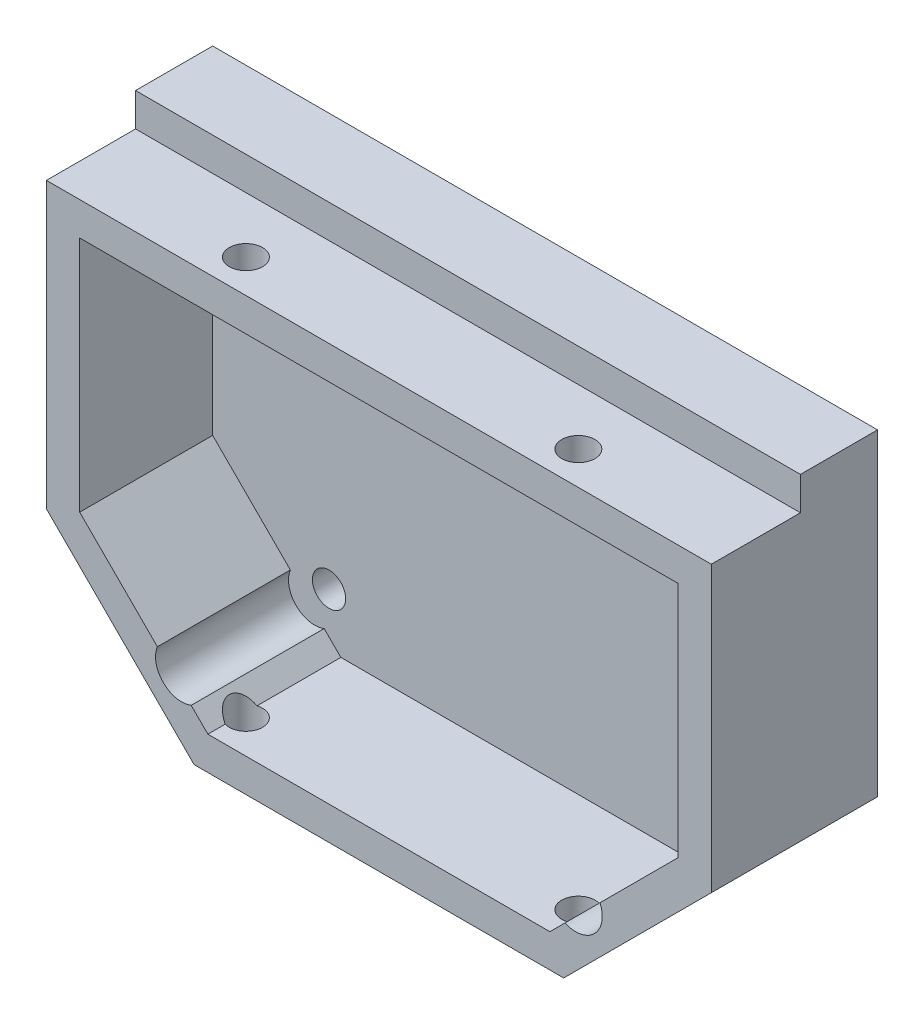
ISO-10303-21;
HEADER;
FILE_DESCRIPTION(('STEP AP214'),'2;1');
FILE_NAME('part.step','',(''),(''),'','','');
FILE_SCHEMA(('AUTOMOTIVE_DESIGN { 1 0 10303 214 1 1 1 1 }'));
ENDSEC;
DATA;
#1=APPLICATION_CONTEXT('core data for automotive mechanical design processes');
#2=APPLICATION_PROTOCOL_DEFINITION('international standard','automotive_design',2000,#1);
#3=PRODUCT_CONTEXT('',#1,'mechanical');
#4=PRODUCT('Part','Part','',(#3));
#5=PRODUCT_RELATED_PRODUCT_CATEGORY('part','',(#4));
#6=PRODUCT_DEFINITION_FORMATION('','',#4);
#7=PRODUCT_DEFINITION_CONTEXT('part definition',#1,'design');
#8=PRODUCT_DEFINITION('design','',#6,#7);
#9=PRODUCT_DEFINITION_SHAPE('','',#8);
#10=(LENGTH_UNIT() NAMED_UNIT(*) SI_UNIT(.MILLI.,.METRE.));
#11=(NAMED_UNIT(*) PLANE_ANGLE_UNIT() SI_UNIT($,.RADIAN.));
#12=(NAMED_UNIT(*) SI_UNIT($,.STERADIAN.) SOLID_ANGLE_UNIT());
#13=UNCERTAINTY_MEASURE_WITH_UNIT(LENGTH_MEASURE(1.E-05),#10,'distance_accuracy_value','');
#14=(GEOMETRIC_REPRESENTATION_CONTEXT(3) GLOBAL_UNCERTAINTY_ASSIGNED_CONTEXT((#13)) GLOBAL_UNIT_ASSIGNED_CONTEXT((#10,
#11,#12)) REPRESENTATION_CONTEXT('',''));
#15=CARTESIAN_POINT('',(0.,0.,0.));
#16=DIRECTION('',(0.,0.,1.));
#17=DIRECTION('',(1.,0.,0.));
#18=AXIS2_PLACEMENT_3D('',#15,#16,#17);
#19=CARTESIAN_POINT('',(26.2059485512443,-27.7968646304275,-12.));
#20=DIRECTION('',(0.707106781186547,-0.707106781186547,0.));
#21=DIRECTION('',(0.707106781186548,0.707106781186548,0.));
#22=AXIS2_PLACEMENT_3D('',#19,#20,#21);
#23=PLANE('',#22);
#24=DIRECTION('',(0.707106781186548,0.707106781186548,0.));
#25=VECTOR('',#24,1.);
#26=CARTESIAN_POINT('',(27.0014065908359,-27.0014065908359,-7.));
#27=LINE('',#26,#25);
#28=CARTESIAN_POINT('',(35.2046858702732,-18.7981273113986,-7.));
#29=VERTEX_POINT('',#28);
#30=CARTESIAN_POINT('',(46.9493152511216,-7.05349793055018,-7.));
#31=VERTEX_POINT('',#30);
#32=EDGE_CURVE('E302',#29,#31,#27,.T.);
#33=ORIENTED_EDGE('',*,*,#32,.F.);
#34=DIRECTION('',(0.,0.,1.));
#35=VECTOR('',#34,1.);
#36=CARTESIAN_POINT('',(35.2046858702732,-18.7981273113986,-14.9280834693644));
#37=LINE('',#36,#35);
#38=CARTESIAN_POINT('',(35.2046858702732,-18.7981273113986,13.));
#39=VERTEX_POINT('',#38);
#40=EDGE_CURVE('E58',#29,#39,#37,.T.);
#41=ORIENTED_EDGE('',*,*,#40,.T.);
#42=DIRECTION('',(0.707106781186548,0.707106781186548,0.));
#43=VECTOR('',#42,1.);
#44=CARTESIAN_POINT('',(27.0014065908359,-27.0014065908359,13.));
#45=LINE('',#44,#43);
#46=CARTESIAN_POINT('',(46.9493152511216,-7.05349793055018,13.));
#47=VERTEX_POINT('',#46);
#48=EDGE_CURVE('E321',#39,#47,#45,.T.);
#49=ORIENTED_EDGE('',*,*,#48,.T.);
#50=DIRECTION('',(0.,0.,1.));
#51=VECTOR('',#50,1.);
#52=CARTESIAN_POINT('',(46.9493152511216,-7.05349793055018,-12.));
#53=LINE('',#52,#51);
#54=EDGE_CURVE('E288',#31,#47,#53,.T.);
#55=ORIENTED_EDGE('',*,*,#54,.F.);
#56=EDGE_LOOP('',(#33,#41,#49,#55));
#57=FACE_BOUND('',#56,.T.);
#58=ADVANCED_FACE('F33',(#57),#23,.F.);
#59=CARTESIAN_POINT('',(-44.5151508429457,-5.58903183648288,-12.));
#60=DIRECTION('',(-0.707106781186539,-0.707106781186556,0.));
#61=DIRECTION('',(0.707106781186556,-0.707106781186539,0.));
#62=AXIS2_PLACEMENT_3D('',#59,#60,#61);
#63=PLANE('',#62);
#64=DIRECTION('',(0.707106781186556,-0.707106781186539,0.));
#65=VECTOR('',#64,1.);
#66=CARTESIAN_POINT('',(-25.0520913397137,-25.0520913397144,-7.));
#67=LINE('',#66,#65);
#68=CARTESIAN_POINT('',(-26.2791792303385,-23.8250034490896,-7.));
#69=VERTEX_POINT('',#68);
#70=CARTESIAN_POINT('',(-23.7717841430678,-26.3323985363603,-7.));
#71=VERTEX_POINT('',#70);
#72=EDGE_CURVE('E284',#69,#71,#67,.T.);
#73=ORIENTED_EDGE('',*,*,#72,.F.);
#74=DIRECTION('',(0.,0.,1.));
#75=VECTOR('',#74,1.);
#76=CARTESIAN_POINT('',(-26.2791792303386,-23.8250034490897,-14.9280834693644));
#77=LINE('',#76,#75);
#78=CARTESIAN_POINT('',(-26.2791792303386,-23.8250034490897,13.));
#79=VERTEX_POINT('',#78);
#80=EDGE_CURVE('E221',#69,#79,#77,.T.);
#81=ORIENTED_EDGE('',*,*,#80,.T.);
#82=DIRECTION('',(0.707106781186556,-0.707106781186539,0.));
#83=VECTOR('',#82,1.);
#84=CARTESIAN_POINT('',(-25.0520913397137,-25.0520913397144,13.));
#85=LINE('',#84,#83);
#86=CARTESIAN_POINT('',(-23.7717841430678,-26.3323985363603,13.));
#87=VERTEX_POINT('',#86);
#88=EDGE_CURVE('E314',#79,#87,#85,.T.);
#89=ORIENTED_EDGE('',*,*,#88,.T.);
#90=DIRECTION('',(0.,0.,1.));
#91=VECTOR('',#90,1.);
#92=CARTESIAN_POINT('',(-23.7717841430678,-26.3323985363603,-12.));
#93=LINE('',#92,#91);
#94=CARTESIAN_POINT('',(-23.7717841430678,-26.3323985363603,10.3937451125171));
#95=VERTEX_POINT('',#94);
#96=EDGE_CURVE('E275',#95,#87,#93,.T.);
#97=ORIENTED_EDGE('',*,*,#96,.F.);
#98=CARTESIAN_POINT('',(-23.0506847488784,-27.0534979305497,8.));
#99=DIRECTION('',(-0.707106781186539,-0.707106781186556,0.));
#100=DIRECTION('',(0.707106781186556,-0.707106781186539,0.));
#101=AXIS2_PLACEMENT_3D('',#98,#99,#100);
#102=ELLIPSE('',#101,3.53553390593269,2.5);
#103=CARTESIAN_POINT('',(-23.7717841430678,-26.3323985363603,5.60625488748287));
#104=VERTEX_POINT('',#103);
#105=EDGE_CURVE('E42',#95,#104,#102,.T.);
#106=ORIENTED_EDGE('',*,*,#105,.T.);
#107=EDGE_CURVE('E303',#71,#104,#93,.T.);
#108=ORIENTED_EDGE('',*,*,#107,.F.);
#109=EDGE_LOOP('',(#73,#81,#89,#97,#106,#108));
#110=FACE_BOUND('',#109,.T.);
#111=ADVANCED_FACE('F431',(#110),#63,.F.);
#112=CARTESIAN_POINT('',(-48.0506847488784,33.6676014636397,-12.));
#113=DIRECTION('',(-1.,0.,0.));
#114=DIRECTION('',(0.,0.,1.));
#115=AXIS2_PLACEMENT_3D('',#112,#113,#114);
#116=PLANE('',#115);
#117=DIRECTION('',(0.,0.,1.));
#118=VECTOR('',#117,1.);
#119=CARTESIAN_POINT('',(-48.0506847488784,-9.12456574241567,-12.));
#120=LINE('',#119,#118);
#121=CARTESIAN_POINT('',(-48.0506847488784,-9.12456574241567,-12.));
#122=VERTEX_POINT('',#121);
#123=CARTESIAN_POINT('',(-48.0506847488784,-9.12456574241567,13.));
#124=VERTEX_POINT('',#123);
#125=EDGE_CURVE('E359',#122,#124,#120,.T.);
#126=ORIENTED_EDGE('',*,*,#125,.T.);
#127=DIRECTION('',(0.,-1.,0.));
#128=VECTOR('',#127,1.);
#129=CARTESIAN_POINT('',(-48.0506847488784,33.6676014636397,13.));
#130=LINE('',#129,#128);
#131=CARTESIAN_POINT('',(-48.0506847488784,33.6676014636397,13.));
#132=VERTEX_POINT('',#131);
#133=EDGE_CURVE('E279',#132,#124,#130,.T.);
#134=ORIENTED_EDGE('',*,*,#133,.F.);
#135=DIRECTION('',(0.,0.,1.));
#136=VECTOR('',#135,1.);
#137=CARTESIAN_POINT('',(-48.0506847488784,33.6676014636397,-12.));
#138=LINE('',#137,#136);
#139=CARTESIAN_POINT('',(-48.0506847488784,33.6676014636397,-0.400000000000001));
#140=VERTEX_POINT('',#139);
#141=EDGE_CURVE('E194',#140,#132,#138,.T.);
#142=ORIENTED_EDGE('',*,*,#141,.F.);
#143=DIRECTION('',(0.,-1.,0.));
#144=VECTOR('',#143,1.);
#145=CARTESIAN_POINT('',(-48.0506847488784,38.6676014636397,-0.400000000000001));
#146=LINE('',#145,#144);
#147=CARTESIAN_POINT('',(-48.0506847488784,38.6676014636397,-0.400000000000001));
#148=VERTEX_POINT('',#147);
#149=EDGE_CURVE('E176',#148,#140,#146,.T.);
#150=ORIENTED_EDGE('',*,*,#149,.F.);
#151=DIRECTION('',(0.,0.,1.));
#152=VECTOR('',#151,1.);
#153=CARTESIAN_POINT('',(-48.0506847488784,38.6676014636397,-12.));
#154=LINE('',#153,#152);
#155=CARTESIAN_POINT('',(-48.0506847488784,38.6676014636397,-12.));
#156=VERTEX_POINT('',#155);
#157=EDGE_CURVE('E183',#156,#148,#154,.T.);
#158=ORIENTED_EDGE('',*,*,#157,.F.);
#159=DIRECTION('',(0.,-1.,0.));
#160=VECTOR('',#159,1.);
#161=CARTESIAN_POINT('',(-48.0506847488784,33.6676014636397,-12.));
#162=LINE('',#161,#160);
#163=EDGE_CURVE('E346',#156,#122,#162,.T.);
#164=ORIENTED_EDGE('',*,*,#163,.T.);
#165=EDGE_LOOP('',(#126,#134,#142,#150,#158,#164));
#166=FACE_BOUND('',#165,.T.);
#167=ADVANCED_FACE('F35',(#166),#116,.T.);
#168=CARTESIAN_POINT('',(-48.0506847488784,33.6676014636397,-12.));
#169=DIRECTION('',(0.,1.,0.));
#170=DIRECTION('',(-1.,0.,0.));
#171=AXIS2_PLACEMENT_3D('',#168,#169,#170);
#172=PLANE('',#171);
#173=DIRECTION('',(1.,0.,0.));
#174=VECTOR('',#173,1.);
#175=CARTESIAN_POINT('',(-48.0506847488784,33.6676014636397,-0.400000000000001));
#176=LINE('',#175,#174);
#177=CARTESIAN_POINT('',(51.9493152511216,33.6676014636397,-0.400000000000001));
#178=VERTEX_POINT('',#177);
#179=EDGE_CURVE('E50',#140,#178,#176,.T.);
#180=ORIENTED_EDGE('',*,*,#179,.F.);
#181=ORIENTED_EDGE('',*,*,#141,.T.);
#182=DIRECTION('',(-1.,0.,0.));
#183=VECTOR('',#182,1.);
#184=CARTESIAN_POINT('',(44.1184363078764,33.6676014636397,13.));
#185=LINE('',#184,#183);
#186=CARTESIAN_POINT('',(51.9493152511216,33.6676014636397,13.));
#187=VERTEX_POINT('',#186);
#188=EDGE_CURVE('E343',#187,#132,#185,.T.);
#189=ORIENTED_EDGE('',*,*,#188,.F.);
#190=DIRECTION('',(0.,0.,1.));
#191=VECTOR('',#190,1.);
#192=CARTESIAN_POINT('',(51.9493152511216,33.6676014636397,-12.));
#193=LINE('',#192,#191);
#194=EDGE_CURVE('E203',#178,#187,#193,.T.);
#195=ORIENTED_EDGE('',*,*,#194,.F.);
#196=EDGE_LOOP('',(#180,#181,#189,#195));
#197=FACE_BOUND('',#196,.T.);
#198=CARTESIAN_POINT('',(26.9493152511216,33.6676014636397,8.));
#199=DIRECTION('',(0.,1.,0.));
#200=DIRECTION('',(-1.,0.,0.));
#201=AXIS2_PLACEMENT_3D('',#198,#199,#200);
#202=CIRCLE('',#201,2.5);
#203=CARTESIAN_POINT('',(24.4493152511216,33.6676014636397,8.));
#204=VERTEX_POINT('',#203);
#205=EDGE_CURVE('E251',#204,#204,#202,.F.);
#206=ORIENTED_EDGE('',*,*,#205,.T.);
#207=EDGE_LOOP('',(#206));
#208=FACE_BOUND('',#207,.T.);
#209=CARTESIAN_POINT('',(-23.0506847488784,33.6676014636397,8.));
#210=DIRECTION('',(0.,1.,0.));
#211=DIRECTION('',(-1.,0.,0.));
#212=AXIS2_PLACEMENT_3D('',#209,#210,#211);
#213=CIRCLE('',#212,2.5);
#214=CARTESIAN_POINT('',(-25.5506847488784,33.6676014636397,8.));
#215=VERTEX_POINT('',#214);
#216=EDGE_CURVE('E263',#215,#215,#213,.F.);
#217=ORIENTED_EDGE('',*,*,#216,.T.);
#218=EDGE_LOOP('',(#217));
#219=FACE_BOUND('',#218,.T.);
#220=ADVANCED_FACE('F379',(#197,#208,#219),#172,.T.);
#221=CARTESIAN_POINT('',(51.9493152511216,33.6676014636397,-12.));
#222=DIRECTION('',(1.,0.,0.));
#223=DIRECTION('',(0.,1.,0.));
#224=AXIS2_PLACEMENT_3D('',#221,#222,#223);
#225=PLANE('',#224);
#226=DIRECTION('',(0.,1.,0.));
#227=VECTOR('',#226,1.);
#228=CARTESIAN_POINT('',(51.9493152511216,33.6676014636397,-12.));
#229=LINE('',#228,#227);
#230=CARTESIAN_POINT('',(51.9493152511216,-9.12456574241567,-12.));
#231=VERTEX_POINT('',#230);
#232=CARTESIAN_POINT('',(51.9493152511216,38.6676014636397,-12.));
#233=VERTEX_POINT('',#232);
#234=EDGE_CURVE('E357',#231,#233,#229,.T.);
#235=ORIENTED_EDGE('',*,*,#234,.T.);
#236=DIRECTION('',(0.,0.,-1.));
#237=VECTOR('',#236,1.);
#238=CARTESIAN_POINT('',(51.9493152511216,38.6676014636397,-12.));
#239=LINE('',#238,#237);
#240=CARTESIAN_POINT('',(51.9493152511216,38.6676014636397,-0.400000000000001));
#241=VERTEX_POINT('',#240);
#242=EDGE_CURVE('E182',#241,#233,#239,.T.);
#243=ORIENTED_EDGE('',*,*,#242,.F.);
#244=DIRECTION('',(0.,-1.,0.));
#245=VECTOR('',#244,1.);
#246=CARTESIAN_POINT('',(51.9493152511216,38.6676014636397,-0.400000000000001));
#247=LINE('',#246,#245);
#248=EDGE_CURVE('E178',#241,#178,#247,.T.);
#249=ORIENTED_EDGE('',*,*,#248,.T.);
#250=ORIENTED_EDGE('',*,*,#194,.T.);
#251=DIRECTION('',(0.,1.,0.));
#252=VECTOR('',#251,1.);
#253=CARTESIAN_POINT('',(51.9493152511216,33.6676014636397,13.));
#254=LINE('',#253,#252);
#255=CARTESIAN_POINT('',(51.9493152511216,-9.12456574241567,13.));
#256=VERTEX_POINT('',#255);
#257=EDGE_CURVE('E340',#256,#187,#254,.T.);
#258=ORIENTED_EDGE('',*,*,#257,.F.);
#259=DIRECTION('',(0.,0.,1.));
#260=VECTOR('',#259,1.);
#261=CARTESIAN_POINT('',(51.9493152511216,-9.12456574241567,-12.));
#262=LINE('',#261,#260);
#263=EDGE_CURVE('E370',#231,#256,#262,.T.);
#264=ORIENTED_EDGE('',*,*,#263,.F.);
#265=EDGE_LOOP('',(#235,#243,#249,#250,#258,#264));
#266=FACE_BOUND('',#265,.T.);
#267=ADVANCED_FACE('F375',(#266),#225,.T.);
#268=CARTESIAN_POINT('',(29.741482457177,-31.3323985363603,-12.));
#269=DIRECTION('',(0.707106781186547,-0.707106781186547,0.));
#270=DIRECTION('',(0.707106781186548,0.707106781186548,0.));
#271=AXIS2_PLACEMENT_3D('',#268,#269,#270);
#272=PLANE('',#271);
#273=ORIENTED_EDGE('',*,*,#263,.T.);
#274=DIRECTION('',(0.707106781186548,0.707106781186548,0.));
#275=VECTOR('',#274,1.);
#276=CARTESIAN_POINT('',(29.741482457177,-31.3323985363603,13.));
#277=LINE('',#276,#275);
#278=CARTESIAN_POINT('',(29.741482457177,-31.3323985363603,13.));
#279=VERTEX_POINT('',#278);
#280=EDGE_CURVE('E337',#279,#256,#277,.T.);
#281=ORIENTED_EDGE('',*,*,#280,.F.);
#282=DIRECTION('',(0.,0.,1.));
#283=VECTOR('',#282,1.);
#284=CARTESIAN_POINT('',(29.741482457177,-31.3323985363603,-12.));
#285=LINE('',#284,#283);
#286=CARTESIAN_POINT('',(29.741482457177,-31.3323985363603,-12.));
#287=VERTEX_POINT('',#286);
#288=EDGE_CURVE('E369',#287,#279,#285,.T.);
#289=ORIENTED_EDGE('',*,*,#288,.F.);
#290=DIRECTION('',(0.707106781186548,0.707106781186548,0.));
#291=VECTOR('',#290,1.);
#292=CARTESIAN_POINT('',(29.741482457177,-31.3323985363603,-12.));
#293=LINE('',#292,#291);
#294=EDGE_CURVE('E354',#287,#231,#293,.T.);
#295=ORIENTED_EDGE('',*,*,#294,.T.);
#296=EDGE_LOOP('',(#273,#281,#289,#295));
#297=FACE_BOUND('',#296,.T.);
#298=ADVANCED_FACE('F577',(#297),#272,.T.);
#299=CARTESIAN_POINT('',(-25.8428519549333,-31.3323985363603,-12.));
#300=DIRECTION('',(0.,-1.,0.));
#301=DIRECTION('',(0.,0.,-1.));
#302=AXIS2_PLACEMENT_3D('',#299,#300,#301);
#303=PLANE('',#302);
#304=CARTESIAN_POINT('',(26.9493152511216,-31.3323985363603,8.));
#305=DIRECTION('',(0.,-1.,0.));
#306=DIRECTION('',(0.,0.,-1.));
#307=AXIS2_PLACEMENT_3D('',#304,#305,#306);
#308=CIRCLE('',#307,2.5);
#309=CARTESIAN_POINT('',(26.9493152511216,-31.3323985363603,5.5));
#310=VERTEX_POINT('',#309);
#311=EDGE_CURVE('E248',#310,#310,#308,.T.);
#312=ORIENTED_EDGE('',*,*,#311,.F.);
#313=EDGE_LOOP('',(#312));
#314=FACE_BOUND('',#313,.T.);
#315=CARTESIAN_POINT('',(-23.0506847488784,-31.3323985363603,8.));
#316=DIRECTION('',(0.,-1.,0.));
#317=DIRECTION('',(0.,0.,-1.));
#318=AXIS2_PLACEMENT_3D('',#315,#316,#317);
#319=CIRCLE('',#318,2.5);
#320=CARTESIAN_POINT('',(-23.0506847488784,-31.3323985363603,5.5));
#321=VERTEX_POINT('',#320);
#322=EDGE_CURVE('E260',#321,#321,#319,.T.);
#323=ORIENTED_EDGE('',*,*,#322,.F.);
#324=EDGE_LOOP('',(#323));
#325=FACE_BOUND('',#324,.T.);
#326=ORIENTED_EDGE('',*,*,#288,.T.);
#327=DIRECTION('',(1.,0.,0.));
#328=VECTOR('',#327,1.);
#329=CARTESIAN_POINT('',(-25.8428519549333,-31.3323985363603,13.));
#330=LINE('',#329,#328);
#331=CARTESIAN_POINT('',(-25.8428519549333,-31.3323985363603,13.));
#332=VERTEX_POINT('',#331);
#333=EDGE_CURVE('E334',#332,#279,#330,.T.);
#334=ORIENTED_EDGE('',*,*,#333,.F.);
#335=DIRECTION('',(0.,0.,1.));
#336=VECTOR('',#335,1.);
#337=CARTESIAN_POINT('',(-25.8428519549333,-31.3323985363603,-12.));
#338=LINE('',#337,#336);
#339=CARTESIAN_POINT('',(-25.8428519549333,-31.3323985363603,-12.));
#340=VERTEX_POINT('',#339);
#341=EDGE_CURVE('E367',#340,#332,#338,.T.);
#342=ORIENTED_EDGE('',*,*,#341,.F.);
#343=DIRECTION('',(1.,0.,0.));
#344=VECTOR('',#343,1.);
#345=CARTESIAN_POINT('',(-25.8428519549333,-31.3323985363603,-12.));
#346=LINE('',#345,#344);
#347=EDGE_CURVE('E351',#340,#287,#346,.T.);
#348=ORIENTED_EDGE('',*,*,#347,.T.);
#349=EDGE_LOOP('',(#326,#334,#342,#348));
#350=FACE_BOUND('',#349,.T.);
#351=ADVANCED_FACE('F572',(#314,#325,#350),#303,.T.);
#352=CARTESIAN_POINT('',(-48.0506847488784,-9.12456574241567,-12.));
#353=DIRECTION('',(-0.707106781186539,-0.707106781186556,0.));
#354=DIRECTION('',(0.707106781186556,-0.707106781186539,0.));
#355=AXIS2_PLACEMENT_3D('',#352,#353,#354);
#356=PLANE('',#355);
#357=ORIENTED_EDGE('',*,*,#341,.T.);
#358=DIRECTION('',(0.707106781186556,-0.707106781186539,0.));
#359=VECTOR('',#358,1.);
#360=CARTESIAN_POINT('',(-48.0506847488784,-9.12456574241567,13.));
#361=LINE('',#360,#359);
#362=EDGE_CURVE('E331',#124,#332,#361,.T.);
#363=ORIENTED_EDGE('',*,*,#362,.F.);
#364=ORIENTED_EDGE('',*,*,#125,.F.);
#365=DIRECTION('',(0.707106781186556,-0.707106781186539,0.));
#366=VECTOR('',#365,1.);
#367=CARTESIAN_POINT('',(-48.0506847488784,-9.12456574241567,-12.));
#368=LINE('',#367,#366);
#369=EDGE_CURVE('E348',#122,#340,#368,.T.);
#370=ORIENTED_EDGE('',*,*,#369,.T.);
#371=EDGE_LOOP('',(#357,#363,#364,#370));
#372=FACE_BOUND('',#371,.T.);
#373=ADVANCED_FACE('F576',(#372),#356,.T.);
#374=CARTESIAN_POINT('',(0.,0.,-12.));
#375=DIRECTION('',(0.,0.,1.));
#376=DIRECTION('',(1.,0.,0.));
#377=AXIS2_PLACEMENT_3D('',#374,#375,#376);
#378=PLANE('',#377);
#379=CARTESIAN_POINT('',(29.4493152511216,-18.3323985363603,-12.));
#380=DIRECTION('',(0.,0.,1.));
#381=DIRECTION('',(1.,0.,0.));
#382=AXIS2_PLACEMENT_3D('',#379,#380,#381);
#383=CIRCLE('',#382,2.5);
#384=CARTESIAN_POINT('',(31.9493152511216,-18.3323985363603,-12.));
#385=VERTEX_POINT('',#384);
#386=EDGE_CURVE('E227',#385,#385,#383,.F.);
#387=ORIENTED_EDGE('',*,*,#386,.F.);
#388=EDGE_LOOP('',(#387));
#389=FACE_BOUND('',#388,.T.);
#390=CARTESIAN_POINT('',(29.4493152511216,23.6676014636397,-12.));
#391=DIRECTION('',(0.,0.,1.));
#392=DIRECTION('',(1.,0.,0.));
#393=AXIS2_PLACEMENT_3D('',#390,#391,#392);
#394=CIRCLE('',#393,2.5);
#395=CARTESIAN_POINT('',(31.9493152511216,23.6676014636397,-12.));
#396=VERTEX_POINT('',#395);
#397=EDGE_CURVE('E233',#396,#396,#394,.F.);
#398=ORIENTED_EDGE('',*,*,#397,.F.);
#399=EDGE_LOOP('',(#398));
#400=FACE_BOUND('',#399,.T.);
#401=CARTESIAN_POINT('',(-25.5506847488784,-18.3323985363603,-12.));
#402=DIRECTION('',(0.,0.,1.));
#403=DIRECTION('',(1.,0.,0.));
#404=AXIS2_PLACEMENT_3D('',#401,#402,#403);
#405=CIRCLE('',#404,2.5);
#406=CARTESIAN_POINT('',(-23.0506847488784,-18.3323985363603,-12.));
#407=VERTEX_POINT('',#406);
#408=EDGE_CURVE('E239',#407,#407,#405,.F.);
#409=ORIENTED_EDGE('',*,*,#408,.F.);
#410=EDGE_LOOP('',(#409));
#411=FACE_BOUND('',#410,.T.);
#412=CARTESIAN_POINT('',(-25.5506847488784,23.6676014636397,-12.));
#413=DIRECTION('',(0.,0.,1.));
#414=DIRECTION('',(1.,0.,0.));
#415=AXIS2_PLACEMENT_3D('',#412,#413,#414);
#416=CIRCLE('',#415,2.5);
#417=CARTESIAN_POINT('',(-23.0506847488784,23.6676014636397,-12.));
#418=VERTEX_POINT('',#417);
#419=EDGE_CURVE('E245',#418,#418,#416,.F.);
#420=ORIENTED_EDGE('',*,*,#419,.F.);
#421=EDGE_LOOP('',(#420));
#422=FACE_BOUND('',#421,.T.);
#423=ORIENTED_EDGE('',*,*,#163,.F.);
#424=DIRECTION('',(-1.,0.,0.));
#425=VECTOR('',#424,1.);
#426=CARTESIAN_POINT('',(-48.0506847488784,38.6676014636397,-12.));
#427=LINE('',#426,#425);
#428=EDGE_CURVE('E189',#233,#156,#427,.T.);
#429=ORIENTED_EDGE('',*,*,#428,.F.);
#430=ORIENTED_EDGE('',*,*,#234,.F.);
#431=ORIENTED_EDGE('',*,*,#294,.F.);
#432=ORIENTED_EDGE('',*,*,#347,.F.);
#433=ORIENTED_EDGE('',*,*,#369,.F.);
#434=EDGE_LOOP('',(#423,#429,#430,#431,#432,#433));
#435=FACE_BOUND('',#434,.T.);
#436=ADVANCED_FACE('F601',(#389,#400,#411,#422,#435),#378,.F.);
#437=CARTESIAN_POINT('',(0.,0.,13.));
#438=DIRECTION('',(0.,0.,1.));
#439=DIRECTION('',(1.,0.,0.));
#440=AXIS2_PLACEMENT_3D('',#437,#438,#439);
#441=PLANE('',#440);
#442=CARTESIAN_POINT('',(31.5473015204024,-20.4080798951315,13.));
#443=DIRECTION('',(0.,0.,1.));
#444=DIRECTION('',(-1.,0.,0.));
#445=AXIS2_PLACEMENT_3D('',#442,#443,#444);
#446=CIRCLE('',#445,3.99604899926763);
#447=CARTESIAN_POINT('',(29.9373489366696,-24.0654642450022,13.));
#448=VERTEX_POINT('',#447);
#449=EDGE_CURVE('E195',#448,#39,#446,.T.);
#450=ORIENTED_EDGE('',*,*,#449,.F.);
#451=CARTESIAN_POINT('',(27.6704146453115,-26.3323985363603,13.));
#452=VERTEX_POINT('',#451);
#453=EDGE_CURVE('E322',#452,#448,#45,.T.);
#454=ORIENTED_EDGE('',*,*,#453,.F.);
#455=DIRECTION('',(1.,0.,0.));
#456=VECTOR('',#455,1.);
#457=CARTESIAN_POINT('',(0.,-26.3323985363603,13.));
#458=LINE('',#457,#456);
#459=EDGE_CURVE('E318',#87,#452,#458,.T.);
#460=ORIENTED_EDGE('',*,*,#459,.F.);
#461=ORIENTED_EDGE('',*,*,#88,.F.);
#462=CARTESIAN_POINT('',(-27.7219050867218,-20.1810130273355,13.));
#463=DIRECTION('',(0.,0.,1.));
#464=DIRECTION('',(-1.,0.,0.));
#465=AXIS2_PLACEMENT_3D('',#462,#463,#464);
#466=CIRCLE('',#465,3.91919941958986);
#467=CARTESIAN_POINT('',(-31.3658955084761,-18.7382871709522,13.));
#468=VERTEX_POINT('',#467);
#469=EDGE_CURVE('E211',#468,#79,#466,.T.);
#470=ORIENTED_EDGE('',*,*,#469,.F.);
#471=CARTESIAN_POINT('',(-43.0506847488784,-7.05349793055015,13.));
#472=VERTEX_POINT('',#471);
#473=EDGE_CURVE('E315',#472,#468,#85,.T.);
#474=ORIENTED_EDGE('',*,*,#473,.F.);
#475=DIRECTION('',(0.,-1.,0.));
#476=VECTOR('',#475,1.);
#477=CARTESIAN_POINT('',(-43.0506847488784,0.,13.));
#478=LINE('',#477,#476);
#479=CARTESIAN_POINT('',(-43.0506847488784,28.6676014636397,13.));
#480=VERTEX_POINT('',#479);
#481=EDGE_CURVE('E272',#480,#472,#478,.T.);
#482=ORIENTED_EDGE('',*,*,#481,.F.);
#483=DIRECTION('',(-1.,0.,0.));
#484=VECTOR('',#483,1.);
#485=CARTESIAN_POINT('',(0.,28.6676014636397,13.));
#486=LINE('',#485,#484);
#487=CARTESIAN_POINT('',(46.9493152511216,28.6676014636397,13.));
#488=VERTEX_POINT('',#487);
#489=EDGE_CURVE('E285',#488,#480,#486,.T.);
#490=ORIENTED_EDGE('',*,*,#489,.F.);
#491=DIRECTION('',(0.,1.,0.));
#492=VECTOR('',#491,1.);
#493=CARTESIAN_POINT('',(46.9493152511216,0.,13.));
#494=LINE('',#493,#492);
#495=EDGE_CURVE('E325',#47,#488,#494,.T.);
#496=ORIENTED_EDGE('',*,*,#495,.F.);
#497=ORIENTED_EDGE('',*,*,#48,.F.);
#498=EDGE_LOOP('',(#450,#454,#460,#461,#470,#474,#482,#490,#496,#497));
#499=FACE_BOUND('',#498,.T.);
#500=ORIENTED_EDGE('',*,*,#133,.T.);
#501=ORIENTED_EDGE('',*,*,#362,.T.);
#502=ORIENTED_EDGE('',*,*,#333,.T.);
#503=ORIENTED_EDGE('',*,*,#280,.T.);
#504=ORIENTED_EDGE('',*,*,#257,.T.);
#505=ORIENTED_EDGE('',*,*,#188,.T.);
#506=EDGE_LOOP('',(#500,#501,#502,#503,#504,#505));
#507=FACE_BOUND('',#506,.T.);
#508=ADVANCED_FACE('F378',(#499,#507),#441,.T.);
#509=CARTESIAN_POINT('',(-43.0506847488784,33.6676014636397,-12.));
#510=DIRECTION('',(-1.,0.,0.));
#511=DIRECTION('',(0.,0.,1.));
#512=AXIS2_PLACEMENT_3D('',#509,#510,#511);
#513=PLANE('',#512);
#514=DIRECTION('',(0.,0.,1.));
#515=VECTOR('',#514,1.);
#516=CARTESIAN_POINT('',(-43.0506847488784,-7.05349793055014,-12.));
#517=LINE('',#516,#515);
#518=CARTESIAN_POINT('',(-43.0506847488784,-7.05349793055015,-7.));
#519=VERTEX_POINT('',#518);
#520=EDGE_CURVE('E273',#519,#472,#517,.T.);
#521=ORIENTED_EDGE('',*,*,#520,.F.);
#522=DIRECTION('',(0.,-1.,0.));
#523=VECTOR('',#522,1.);
#524=CARTESIAN_POINT('',(-43.0506847488784,0.,-7.));
#525=LINE('',#524,#523);
#526=CARTESIAN_POINT('',(-43.0506847488784,28.6676014636397,-7.));
#527=VERTEX_POINT('',#526);
#528=EDGE_CURVE('E281',#527,#519,#525,.T.);
#529=ORIENTED_EDGE('',*,*,#528,.F.);
#530=DIRECTION('',(0.,0.,1.));
#531=VECTOR('',#530,1.);
#532=CARTESIAN_POINT('',(-43.0506847488784,28.6676014636397,-12.));
#533=LINE('',#532,#531);
#534=EDGE_CURVE('E277',#527,#480,#533,.T.);
#535=ORIENTED_EDGE('',*,*,#534,.T.);
#536=ORIENTED_EDGE('',*,*,#481,.T.);
#537=EDGE_LOOP('',(#521,#529,#535,#536));
#538=FACE_BOUND('',#537,.T.);
#539=ADVANCED_FACE('F399',(#538),#513,.F.);
#540=CARTESIAN_POINT('',(-48.0506847488784,28.6676014636397,-12.));
#541=DIRECTION('',(0.,1.,0.));
#542=DIRECTION('',(-1.,0.,0.));
#543=AXIS2_PLACEMENT_3D('',#540,#541,#542);
#544=PLANE('',#543);
#545=CARTESIAN_POINT('',(26.9493152511216,28.6676014636397,8.));
#546=DIRECTION('',(0.,1.,0.));
#547=DIRECTION('',(-1.,0.,0.));
#548=AXIS2_PLACEMENT_3D('',#545,#546,#547);
#549=CIRCLE('',#548,2.5);
#550=CARTESIAN_POINT('',(24.4493152511216,28.6676014636397,8.));
#551=VERTEX_POINT('',#550);
#552=EDGE_CURVE('E257',#551,#551,#549,.T.);
#553=ORIENTED_EDGE('',*,*,#552,.T.);
#554=EDGE_LOOP('',(#553));
#555=FACE_BOUND('',#554,.T.);
#556=CARTESIAN_POINT('',(-23.0506847488784,28.6676014636397,8.));
#557=DIRECTION('',(0.,1.,0.));
#558=DIRECTION('',(-1.,0.,0.));
#559=AXIS2_PLACEMENT_3D('',#556,#557,#558);
#560=CIRCLE('',#559,2.5);
#561=CARTESIAN_POINT('',(-25.5506847488784,28.6676014636397,8.));
#562=VERTEX_POINT('',#561);
#563=EDGE_CURVE('E269',#562,#562,#560,.T.);
#564=ORIENTED_EDGE('',*,*,#563,.T.);
#565=EDGE_LOOP('',(#564));
#566=FACE_BOUND('',#565,.T.);
#567=ORIENTED_EDGE('',*,*,#534,.F.);
#568=DIRECTION('',(-1.,0.,0.));
#569=VECTOR('',#568,1.);
#570=CARTESIAN_POINT('',(0.,28.6676014636397,-7.));
#571=LINE('',#570,#569);
#572=CARTESIAN_POINT('',(46.9493152511216,28.6676014636397,-7.));
#573=VERTEX_POINT('',#572);
#574=EDGE_CURVE('E276',#573,#527,#571,.T.);
#575=ORIENTED_EDGE('',*,*,#574,.F.);
#576=DIRECTION('',(0.,0.,1.));
#577=VECTOR('',#576,1.);
#578=CARTESIAN_POINT('',(46.9493152511216,28.6676014636397,-12.));
#579=LINE('',#578,#577);
#580=EDGE_CURVE('E280',#573,#488,#579,.T.);
#581=ORIENTED_EDGE('',*,*,#580,.T.);
#582=ORIENTED_EDGE('',*,*,#489,.T.);
#583=EDGE_LOOP('',(#567,#575,#581,#582));
#584=FACE_BOUND('',#583,.T.);
#585=ADVANCED_FACE('F395',(#555,#566,#584),#544,.F.);
#586=CARTESIAN_POINT('',(46.9493152511216,33.6676014636397,-12.));
#587=DIRECTION('',(1.,0.,0.));
#588=DIRECTION('',(0.,1.,0.));
#589=AXIS2_PLACEMENT_3D('',#586,#587,#588);
#590=PLANE('',#589);
#591=ORIENTED_EDGE('',*,*,#580,.F.);
#592=DIRECTION('',(0.,1.,0.));
#593=VECTOR('',#592,1.);
#594=CARTESIAN_POINT('',(46.9493152511216,0.,-7.));
#595=LINE('',#594,#593);
#596=EDGE_CURVE('E290',#31,#573,#595,.T.);
#597=ORIENTED_EDGE('',*,*,#596,.F.);
#598=ORIENTED_EDGE('',*,*,#54,.T.);
#599=ORIENTED_EDGE('',*,*,#495,.T.);
#600=EDGE_LOOP('',(#591,#597,#598,#599));
#601=FACE_BOUND('',#600,.T.);
#602=ADVANCED_FACE('F398',(#601),#590,.F.);
#603=ORIENTED_EDGE('',*,*,#453,.T.);
#604=DIRECTION('',(0.,0.,1.));
#605=VECTOR('',#604,1.);
#606=CARTESIAN_POINT('',(29.9373489366696,-24.0654642450022,-14.9280834693644));
#607=LINE('',#606,#605);
#608=CARTESIAN_POINT('',(29.9373489366696,-24.0654642450022,-7.));
#609=VERTEX_POINT('',#608);
#610=EDGE_CURVE('E212',#609,#448,#607,.T.);
#611=ORIENTED_EDGE('',*,*,#610,.F.);
#612=CARTESIAN_POINT('',(27.6704146453115,-26.3323985363603,-7.));
#613=VERTEX_POINT('',#612);
#614=EDGE_CURVE('E296',#613,#609,#27,.T.);
#615=ORIENTED_EDGE('',*,*,#614,.F.);
#616=DIRECTION('',(0.,0.,1.));
#617=VECTOR('',#616,1.);
#618=CARTESIAN_POINT('',(27.6704146453115,-26.3323985363603,-12.));
#619=LINE('',#618,#617);
#620=CARTESIAN_POINT('',(27.6704146453115,-26.3323985363603,5.60625488748302));
#621=VERTEX_POINT('',#620);
#622=EDGE_CURVE('E293',#613,#621,#619,.T.);
#623=ORIENTED_EDGE('',*,*,#622,.T.);
#624=CARTESIAN_POINT('',(26.9493152511216,-27.0534979305502,8.));
#625=DIRECTION('',(0.707106781186547,-0.707106781186547,0.));
#626=DIRECTION('',(-0.707106781186548,-0.707106781186548,0.));
#627=AXIS2_PLACEMENT_3D('',#624,#625,#626);
#628=ELLIPSE('',#627,3.53553390593274,2.5);
#629=CARTESIAN_POINT('',(27.6704146453115,-26.3323985363603,10.393745112517));
#630=VERTEX_POINT('',#629);
#631=EDGE_CURVE('E254',#621,#630,#628,.T.);
#632=ORIENTED_EDGE('',*,*,#631,.T.);
#633=EDGE_CURVE('E299',#630,#452,#619,.T.);
#634=ORIENTED_EDGE('',*,*,#633,.T.);
#635=EDGE_LOOP('',(#603,#611,#615,#623,#632,#634));
#636=FACE_BOUND('',#635,.T.);
#637=ADVANCED_FACE('F440',(#636),#23,.F.);
#638=CARTESIAN_POINT('',(-25.8428519549333,-26.3323985363603,-12.));
#639=DIRECTION('',(0.,-1.,0.));
#640=DIRECTION('',(0.,0.,-1.));
#641=AXIS2_PLACEMENT_3D('',#638,#639,#640);
#642=PLANE('',#641);
#643=ORIENTED_EDGE('',*,*,#633,.F.);
#644=CARTESIAN_POINT('',(26.9493152511216,-26.3323985363603,8.));
#645=DIRECTION('',(0.,-1.,0.));
#646=DIRECTION('',(0.,0.,-1.));
#647=AXIS2_PLACEMENT_3D('',#644,#645,#646);
#648=CIRCLE('',#647,2.5);
#649=EDGE_CURVE('E11',#630,#621,#648,.T.);
#650=ORIENTED_EDGE('',*,*,#649,.T.);
#651=ORIENTED_EDGE('',*,*,#622,.F.);
#652=DIRECTION('',(1.,0.,0.));
#653=VECTOR('',#652,1.);
#654=CARTESIAN_POINT('',(0.,-26.3323985363603,-7.));
#655=LINE('',#654,#653);
#656=EDGE_CURVE('E306',#71,#613,#655,.T.);
#657=ORIENTED_EDGE('',*,*,#656,.F.);
#658=ORIENTED_EDGE('',*,*,#107,.T.);
#659=CARTESIAN_POINT('',(-23.0506847488784,-26.3323985363603,8.));
#660=DIRECTION('',(0.,-1.,0.));
#661=DIRECTION('',(0.,0.,-1.));
#662=AXIS2_PLACEMENT_3D('',#659,#660,#661);
#663=CIRCLE('',#662,2.5);
#664=EDGE_CURVE('E266',#104,#95,#663,.T.);
#665=ORIENTED_EDGE('',*,*,#664,.T.);
#666=ORIENTED_EDGE('',*,*,#96,.T.);
#667=ORIENTED_EDGE('',*,*,#459,.T.);
#668=EDGE_LOOP('',(#643,#650,#651,#657,#658,#665,#666,#667));
#669=FACE_BOUND('',#668,.T.);
#670=ADVANCED_FACE('F436',(#669),#642,.F.);
#671=ORIENTED_EDGE('',*,*,#473,.T.);
#672=DIRECTION('',(0.,0.,1.));
#673=VECTOR('',#672,1.);
#674=CARTESIAN_POINT('',(-31.3658955084761,-18.7382871709522,-14.9280834693644));
#675=LINE('',#674,#673);
#676=CARTESIAN_POINT('',(-31.3658955084761,-18.7382871709522,-7.));
#677=VERTEX_POINT('',#676);
#678=EDGE_CURVE('E219',#677,#468,#675,.T.);
#679=ORIENTED_EDGE('',*,*,#678,.F.);
#680=EDGE_CURVE('E309',#519,#677,#67,.T.);
#681=ORIENTED_EDGE('',*,*,#680,.F.);
#682=ORIENTED_EDGE('',*,*,#520,.T.);
#683=EDGE_LOOP('',(#671,#679,#681,#682));
#684=FACE_BOUND('',#683,.T.);
#685=ADVANCED_FACE('F425',(#684),#63,.F.);
#686=CARTESIAN_POINT('',(0.,0.,-7.));
#687=DIRECTION('',(0.,0.,1.));
#688=DIRECTION('',(1.,0.,0.));
#689=AXIS2_PLACEMENT_3D('',#686,#687,#688);
#690=PLANE('',#689);
#691=CARTESIAN_POINT('',(29.4493152511216,-18.3323985363603,-7.));
#692=DIRECTION('',(0.,0.,1.));
#693=DIRECTION('',(1.,0.,0.));
#694=AXIS2_PLACEMENT_3D('',#691,#692,#693);
#695=CIRCLE('',#694,2.5);
#696=CARTESIAN_POINT('',(31.9493152511216,-18.3323985363603,-7.));
#697=VERTEX_POINT('',#696);
#698=EDGE_CURVE('E218',#697,#697,#695,.T.);
#699=ORIENTED_EDGE('',*,*,#698,.F.);
#700=EDGE_LOOP('',(#699));
#701=FACE_BOUND('',#700,.T.);
#702=CARTESIAN_POINT('',(29.4493152511216,23.6676014636397,-7.));
#703=DIRECTION('',(0.,0.,1.));
#704=DIRECTION('',(1.,0.,0.));
#705=AXIS2_PLACEMENT_3D('',#702,#703,#704);
#706=CIRCLE('',#705,2.5);
#707=CARTESIAN_POINT('',(31.9493152511216,23.6676014636397,-7.));
#708=VERTEX_POINT('',#707);
#709=EDGE_CURVE('E230',#708,#708,#706,.T.);
#710=ORIENTED_EDGE('',*,*,#709,.F.);
#711=EDGE_LOOP('',(#710));
#712=FACE_BOUND('',#711,.T.);
#713=CARTESIAN_POINT('',(-25.5506847488784,-18.3323985363603,-7.));
#714=DIRECTION('',(0.,0.,1.));
#715=DIRECTION('',(1.,0.,0.));
#716=AXIS2_PLACEMENT_3D('',#713,#714,#715);
#717=CIRCLE('',#716,2.5);
#718=CARTESIAN_POINT('',(-23.0506847488784,-18.3323985363603,-7.));
#719=VERTEX_POINT('',#718);
#720=EDGE_CURVE('E236',#719,#719,#717,.T.);
#721=ORIENTED_EDGE('',*,*,#720,.F.);
#722=EDGE_LOOP('',(#721));
#723=FACE_BOUND('',#722,.T.);
#724=CARTESIAN_POINT('',(-25.5506847488784,23.6676014636397,-7.));
#725=DIRECTION('',(0.,0.,1.));
#726=DIRECTION('',(1.,0.,0.));
#727=AXIS2_PLACEMENT_3D('',#724,#725,#726);
#728=CIRCLE('',#727,2.5);
#729=CARTESIAN_POINT('',(-23.0506847488784,23.6676014636397,-7.));
#730=VERTEX_POINT('',#729);
#731=EDGE_CURVE('E242',#730,#730,#728,.T.);
#732=ORIENTED_EDGE('',*,*,#731,.F.);
#733=EDGE_LOOP('',(#732));
#734=FACE_BOUND('',#733,.T.);
#735=ORIENTED_EDGE('',*,*,#528,.T.);
#736=ORIENTED_EDGE('',*,*,#680,.T.);
#737=CARTESIAN_POINT('',(-27.7219050867218,-20.1810130273355,-7.));
#738=DIRECTION('',(0.,0.,1.));
#739=DIRECTION('',(1.,0.,0.));
#740=AXIS2_PLACEMENT_3D('',#737,#738,#739);
#741=CIRCLE('',#740,3.91919941958986);
#742=EDGE_CURVE('E216',#69,#677,#741,.F.);
#743=ORIENTED_EDGE('',*,*,#742,.F.);
#744=ORIENTED_EDGE('',*,*,#72,.T.);
#745=ORIENTED_EDGE('',*,*,#656,.T.);
#746=ORIENTED_EDGE('',*,*,#614,.T.);
#747=CARTESIAN_POINT('',(31.5473015204024,-20.4080798951315,-7.));
#748=DIRECTION('',(0.,0.,1.));
#749=DIRECTION('',(1.,0.,0.));
#750=AXIS2_PLACEMENT_3D('',#747,#748,#749);
#751=CIRCLE('',#750,3.99604899926763);
#752=EDGE_CURVE('E210',#29,#609,#751,.F.);
#753=ORIENTED_EDGE('',*,*,#752,.F.);
#754=ORIENTED_EDGE('',*,*,#32,.T.);
#755=ORIENTED_EDGE('',*,*,#596,.T.);
#756=ORIENTED_EDGE('',*,*,#574,.T.);
#757=EDGE_LOOP('',(#735,#736,#743,#744,#745,#746,#753,#754,#755,#756));
#758=FACE_BOUND('',#757,.T.);
#759=ADVANCED_FACE('F410',(#701,#712,#723,#734,#758),#690,.T.);
#760=CARTESIAN_POINT('',(-23.0506847488784,40.7386692755052,8.));
#761=DIRECTION('',(0.,-1.,0.));
#762=DIRECTION('',(0.,0.,-1.));
#763=AXIS2_PLACEMENT_3D('',#760,#761,#762);
#764=CYLINDRICAL_SURFACE('',#763,2.5);
#765=ORIENTED_EDGE('',*,*,#322,.T.);
#766=EDGE_LOOP('',(#765));
#767=FACE_BOUND('',#766,.T.);
#768=ORIENTED_EDGE('',*,*,#105,.F.);
#769=ORIENTED_EDGE('',*,*,#664,.F.);
#770=EDGE_LOOP('',(#768,#769));
#771=FACE_BOUND('',#770,.T.);
#772=ADVANCED_FACE('F391',(#767,#771),#764,.F.);
#773=ORIENTED_EDGE('',*,*,#216,.F.);
#774=EDGE_LOOP('',(#773));
#775=FACE_BOUND('',#774,.T.);
#776=ORIENTED_EDGE('',*,*,#563,.F.);
#777=EDGE_LOOP('',(#776));
#778=FACE_BOUND('',#777,.T.);
#779=ADVANCED_FACE('F387',(#775,#778),#764,.F.);
#780=CARTESIAN_POINT('',(26.9493152511216,40.7386692755052,8.));
#781=DIRECTION('',(0.,-1.,0.));
#782=DIRECTION('',(0.,0.,-1.));
#783=AXIS2_PLACEMENT_3D('',#780,#781,#782);
#784=CYLINDRICAL_SURFACE('',#783,2.5);
#785=ORIENTED_EDGE('',*,*,#311,.T.);
#786=EDGE_LOOP('',(#785));
#787=FACE_BOUND('',#786,.T.);
#788=ORIENTED_EDGE('',*,*,#649,.F.);
#789=ORIENTED_EDGE('',*,*,#631,.F.);
#790=EDGE_LOOP('',(#788,#789));
#791=FACE_BOUND('',#790,.T.);
#792=ADVANCED_FACE('F390',(#787,#791),#784,.F.);
#793=ORIENTED_EDGE('',*,*,#205,.F.);
#794=EDGE_LOOP('',(#793));
#795=FACE_BOUND('',#794,.T.);
#796=ORIENTED_EDGE('',*,*,#552,.F.);
#797=EDGE_LOOP('',(#796));
#798=FACE_BOUND('',#797,.T.);
#799=ADVANCED_FACE('F463',(#795,#798),#784,.F.);
#800=CARTESIAN_POINT('',(-25.5506847488784,23.6676014636397,-19.0710678118655));
#801=DIRECTION('',(0.,0.,1.));
#802=DIRECTION('',(1.,0.,0.));
#803=AXIS2_PLACEMENT_3D('',#800,#801,#802);
#804=CYLINDRICAL_SURFACE('',#803,2.5);
#805=ORIENTED_EDGE('',*,*,#419,.T.);
#806=EDGE_LOOP('',(#805));
#807=FACE_BOUND('',#806,.T.);
#808=ORIENTED_EDGE('',*,*,#731,.T.);
#809=EDGE_LOOP('',(#808));
#810=FACE_BOUND('',#809,.T.);
#811=ADVANCED_FACE('F466',(#807,#810),#804,.F.);
#812=CARTESIAN_POINT('',(-25.5506847488784,-18.3323985363603,-19.0710678118655));
#813=DIRECTION('',(0.,0.,1.));
#814=DIRECTION('',(1.,0.,0.));
#815=AXIS2_PLACEMENT_3D('',#812,#813,#814);
#816=CYLINDRICAL_SURFACE('',#815,2.5);
#817=ORIENTED_EDGE('',*,*,#408,.T.);
#818=EDGE_LOOP('',(#817));
#819=FACE_BOUND('',#818,.T.);
#820=ORIENTED_EDGE('',*,*,#720,.T.);
#821=EDGE_LOOP('',(#820));
#822=FACE_BOUND('',#821,.T.);
#823=ADVANCED_FACE('F470',(#819,#822),#816,.F.);
#824=CARTESIAN_POINT('',(29.4493152511216,23.6676014636397,-19.0710678118655));
#825=DIRECTION('',(0.,0.,1.));
#826=DIRECTION('',(1.,0.,0.));
#827=AXIS2_PLACEMENT_3D('',#824,#825,#826);
#828=CYLINDRICAL_SURFACE('',#827,2.5);
#829=ORIENTED_EDGE('',*,*,#397,.T.);
#830=EDGE_LOOP('',(#829));
#831=FACE_BOUND('',#830,.T.);
#832=ORIENTED_EDGE('',*,*,#709,.T.);
#833=EDGE_LOOP('',(#832));
#834=FACE_BOUND('',#833,.T.);
#835=ADVANCED_FACE('F474',(#831,#834),#828,.F.);
#836=CARTESIAN_POINT('',(29.4493152511216,-18.3323985363603,-19.0710678118655));
#837=DIRECTION('',(0.,0.,1.));
#838=DIRECTION('',(1.,0.,0.));
#839=AXIS2_PLACEMENT_3D('',#836,#837,#838);
#840=CYLINDRICAL_SURFACE('',#839,2.5);
#841=ORIENTED_EDGE('',*,*,#386,.T.);
#842=EDGE_LOOP('',(#841));
#843=FACE_BOUND('',#842,.T.);
#844=ORIENTED_EDGE('',*,*,#698,.T.);
#845=EDGE_LOOP('',(#844));
#846=FACE_BOUND('',#845,.T.);
#847=ADVANCED_FACE('F478',(#843,#846),#840,.F.);
#848=CARTESIAN_POINT('',(-27.7219050867218,-20.1810130273355,-14.9280834693644));
#849=DIRECTION('',(0.,0.,1.));
#850=DIRECTION('',(1.,0.,0.));
#851=AXIS2_PLACEMENT_3D('',#848,#849,#850);
#852=CYLINDRICAL_SURFACE('',#851,3.91919941958986);
#853=ORIENTED_EDGE('',*,*,#742,.T.);
#854=ORIENTED_EDGE('',*,*,#678,.T.);
#855=ORIENTED_EDGE('',*,*,#469,.T.);
#856=ORIENTED_EDGE('',*,*,#80,.F.);
#857=EDGE_LOOP('',(#853,#854,#855,#856));
#858=FACE_BOUND('',#857,.T.);
#859=ADVANCED_FACE('F427',(#858),#852,.F.);
#860=CARTESIAN_POINT('',(31.5473015204024,-20.4080798951315,-14.9280834693644));
#861=DIRECTION('',(0.,0.,1.));
#862=DIRECTION('',(1.,0.,0.));
#863=AXIS2_PLACEMENT_3D('',#860,#861,#862);
#864=CYLINDRICAL_SURFACE('',#863,3.99604899926763);
#865=ORIENTED_EDGE('',*,*,#752,.T.);
#866=ORIENTED_EDGE('',*,*,#610,.T.);
#867=ORIENTED_EDGE('',*,*,#449,.T.);
#868=ORIENTED_EDGE('',*,*,#40,.F.);
#869=EDGE_LOOP('',(#865,#866,#867,#868));
#870=FACE_BOUND('',#869,.T.);
#871=ADVANCED_FACE('F442',(#870),#864,.F.);
#872=CARTESIAN_POINT('',(-48.0506847488784,38.6676014636397,-0.400000000000001));
#873=DIRECTION('',(0.,0.,-1.));
#874=DIRECTION('',(-1.,0.,0.));
#875=AXIS2_PLACEMENT_3D('',#872,#873,#874);
#876=PLANE('',#875);
#877=ORIENTED_EDGE('',*,*,#179,.T.);
#878=ORIENTED_EDGE('',*,*,#248,.F.);
#879=DIRECTION('',(1.,0.,0.));
#880=VECTOR('',#879,1.);
#881=CARTESIAN_POINT('',(-48.0506847488784,38.6676014636397,-0.400000000000001));
#882=LINE('',#881,#880);
#883=EDGE_CURVE('E172',#148,#241,#882,.T.);
#884=ORIENTED_EDGE('',*,*,#883,.F.);
#885=ORIENTED_EDGE('',*,*,#149,.T.);
#886=EDGE_LOOP('',(#877,#878,#884,#885));
#887=FACE_BOUND('',#886,.T.);
#888=ADVANCED_FACE('F174',(#887),#876,.F.);
#889=CARTESIAN_POINT('',(0.,38.6676014636397,0.));
#890=DIRECTION('',(0.,1.,0.));
#891=DIRECTION('',(-1.,0.,0.));
#892=AXIS2_PLACEMENT_3D('',#889,#890,#891);
#893=PLANE('',#892);
#894=ORIENTED_EDGE('',*,*,#157,.T.);
#895=ORIENTED_EDGE('',*,*,#883,.T.);
#896=ORIENTED_EDGE('',*,*,#242,.T.);
#897=ORIENTED_EDGE('',*,*,#428,.T.);
#898=EDGE_LOOP('',(#894,#895,#896,#897));
#899=FACE_BOUND('',#898,.T.);
#900=ADVANCED_FACE('F187',(#899),#893,.T.);
#901=CLOSED_SHELL('',(#58,#111,#167,#220,#267,#298,#351,#373,#436,#508,#539,#585,#602,#637,#670,
#685,#759,#772,#779,#792,#799,#811,#823,#835,#847,#859,#871,#888,#900));
#902=MANIFOLD_SOLID_BREP('B2',#901);
#903=ADVANCED_BREP_SHAPE_REPRESENTATION('',(#18,#902),#14);
#904=SHAPE_DEFINITION_REPRESENTATION(#9,#903);
ENDSEC;
END-ISO-10303-21;
